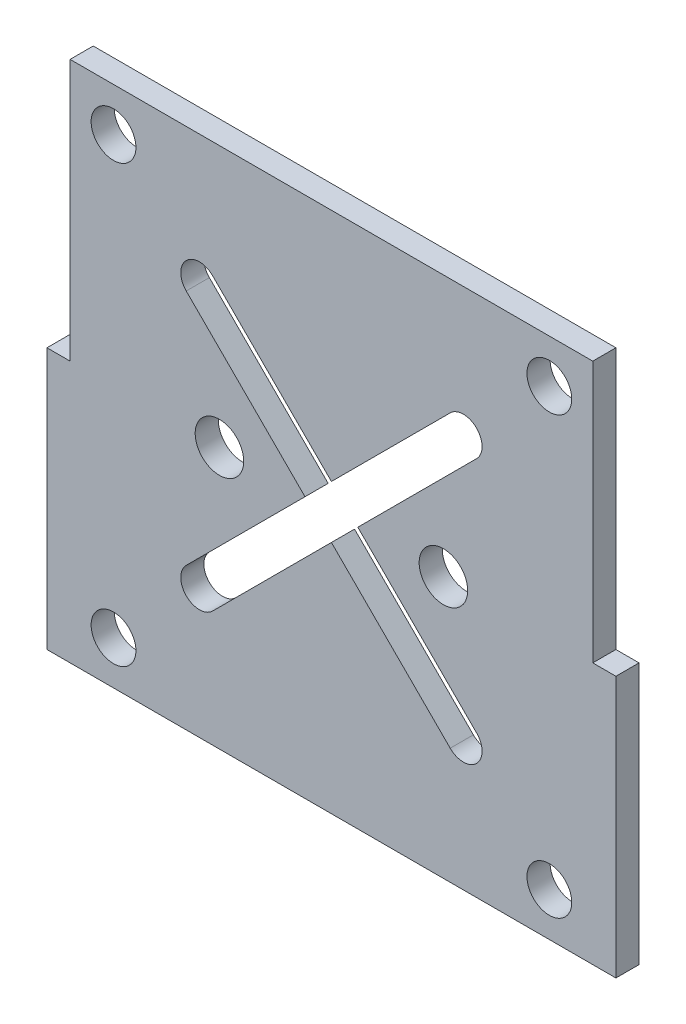
ISO-10303-21;
HEADER;
FILE_DESCRIPTION(('STEP AP214'),'2;1');
FILE_NAME('part.step','',(''),(''),'','','');
FILE_SCHEMA(('AUTOMOTIVE_DESIGN { 1 0 10303 214 1 1 1 1 }'));
ENDSEC;
DATA;
#1=APPLICATION_CONTEXT('core data for automotive mechanical design processes');
#2=APPLICATION_PROTOCOL_DEFINITION('international standard','automotive_design',2000,#1);
#3=PRODUCT_CONTEXT('',#1,'mechanical');
#4=PRODUCT('Part','Part','',(#3));
#5=PRODUCT_RELATED_PRODUCT_CATEGORY('part','',(#4));
#6=PRODUCT_DEFINITION_FORMATION('','',#4);
#7=PRODUCT_DEFINITION_CONTEXT('part definition',#1,'design');
#8=PRODUCT_DEFINITION('design','',#6,#7);
#9=PRODUCT_DEFINITION_SHAPE('','',#8);
#10=(LENGTH_UNIT() NAMED_UNIT(*) SI_UNIT(.MILLI.,.METRE.));
#11=(NAMED_UNIT(*) PLANE_ANGLE_UNIT() SI_UNIT($,.RADIAN.));
#12=(NAMED_UNIT(*) SI_UNIT($,.STERADIAN.) SOLID_ANGLE_UNIT());
#13=UNCERTAINTY_MEASURE_WITH_UNIT(LENGTH_MEASURE(1.E-05),#10,'distance_accuracy_value','');
#14=(GEOMETRIC_REPRESENTATION_CONTEXT(3) GLOBAL_UNCERTAINTY_ASSIGNED_CONTEXT((#13)) GLOBAL_UNIT_ASSIGNED_CONTEXT((#10,
#11,#12)) REPRESENTATION_CONTEXT('',''));
#15=CARTESIAN_POINT('',(0.,0.,0.));
#16=DIRECTION('',(0.,0.,1.));
#17=DIRECTION('',(1.,0.,0.));
#18=AXIS2_PLACEMENT_3D('',#15,#16,#17);
#19=CARTESIAN_POINT('',(35.,-35.,3.1));
#20=DIRECTION('',(-1.,0.,0.));
#21=DIRECTION('',(0.,0.,1.));
#22=AXIS2_PLACEMENT_3D('',#19,#20,#21);
#23=PLANE('',#22);
#24=DIRECTION('',(0.,0.,1.));
#25=VECTOR('',#24,1.);
#26=CARTESIAN_POINT('',(35.,0.,0.));
#27=LINE('',#26,#25);
#28=CARTESIAN_POINT('',(35.,0.,0.));
#29=VERTEX_POINT('',#28);
#30=CARTESIAN_POINT('',(35.,0.,3.1));
#31=VERTEX_POINT('',#30);
#32=EDGE_CURVE('E351',#29,#31,#27,.T.);
#33=ORIENTED_EDGE('',*,*,#32,.F.);
#34=DIRECTION('',(0.,1.,0.));
#35=VECTOR('',#34,1.);
#36=CARTESIAN_POINT('',(35.,-35.,0.));
#37=LINE('',#36,#35);
#38=CARTESIAN_POINT('',(35.,35.,0.));
#39=VERTEX_POINT('',#38);
#40=EDGE_CURVE('E354',#29,#39,#37,.T.);
#41=ORIENTED_EDGE('',*,*,#40,.T.);
#42=DIRECTION('',(0.,0.,-1.));
#43=VECTOR('',#42,1.);
#44=CARTESIAN_POINT('',(35.,35.,3.1));
#45=LINE('',#44,#43);
#46=CARTESIAN_POINT('',(35.,35.,3.1));
#47=VERTEX_POINT('',#46);
#48=EDGE_CURVE('E267',#47,#39,#45,.T.);
#49=ORIENTED_EDGE('',*,*,#48,.F.);
#50=DIRECTION('',(0.,1.,0.));
#51=VECTOR('',#50,1.);
#52=CARTESIAN_POINT('',(35.,-35.,3.1));
#53=LINE('',#52,#51);
#54=EDGE_CURVE('E356',#31,#47,#53,.T.);
#55=ORIENTED_EDGE('',*,*,#54,.F.);
#56=EDGE_LOOP('',(#33,#41,#49,#55));
#57=FACE_BOUND('',#56,.T.);
#58=ADVANCED_FACE('F36',(#57),#23,.F.);
#59=CARTESIAN_POINT('',(0.,0.,3.1));
#60=DIRECTION('',(0.,0.,-1.));
#61=DIRECTION('',(-1.,0.,0.));
#62=AXIS2_PLACEMENT_3D('',#59,#60,#61);
#63=PLANE('',#62);
#64=DIRECTION('',(0.707106781186548,-0.707106781186547,0.));
#65=VECTOR('',#64,1.);
#66=CARTESIAN_POINT('',(-19.4473576572875,15.9118237513547,3.1));
#67=LINE('',#66,#65);
#68=CARTESIAN_POINT('',(-19.4473576572875,15.9118237513547,3.1));
#69=VERTEX_POINT('',#68);
#70=CARTESIAN_POINT('',(-3.53745508059013,0.00192117465741167,3.1));
#71=VERTEX_POINT('',#70);
#72=EDGE_CURVE('E183',#69,#71,#67,.T.);
#73=ORIENTED_EDGE('',*,*,#72,.F.);
#74=CARTESIAN_POINT('',(-17.6795907043211,17.6795907043211,3.1));
#75=DIRECTION('',(0.,0.,1.));
#76=DIRECTION('',(1.,0.,0.));
#77=AXIS2_PLACEMENT_3D('',#74,#75,#76);
#78=CIRCLE('',#77,2.5);
#79=CARTESIAN_POINT('',(-15.9118237513547,19.4473576572875,3.1));
#80=VERTEX_POINT('',#79);
#81=EDGE_CURVE('E50',#80,#69,#78,.T.);
#82=ORIENTED_EDGE('',*,*,#81,.F.);
#83=DIRECTION('',(-0.707106781186547,0.707106781186548,0.));
#84=VECTOR('',#83,1.);
#85=CARTESIAN_POINT('',(-15.9118237513547,19.4473576572875,3.1));
#86=LINE('',#85,#84);
#87=CARTESIAN_POINT('',(-0.00192117465740766,3.53745508059014,3.1));
#88=VERTEX_POINT('',#87);
#89=EDGE_CURVE('E217',#88,#80,#86,.T.);
#90=ORIENTED_EDGE('',*,*,#89,.F.);
#91=DIRECTION('',(-0.707106781186547,-0.707106781186548,0.));
#92=VECTOR('',#91,1.);
#93=CARTESIAN_POINT('',(15.9079814020399,19.4473576572875,3.1));
#94=LINE('',#93,#92);
#95=CARTESIAN_POINT('',(15.9079814020399,19.4473576572875,3.1));
#96=VERTEX_POINT('',#95);
#97=EDGE_CURVE('E214',#96,#88,#94,.T.);
#98=ORIENTED_EDGE('',*,*,#97,.F.);
#99=CARTESIAN_POINT('',(17.6757483550063,17.6795907043211,3.1));
#100=DIRECTION('',(0.,0.,1.));
#101=DIRECTION('',(1.,0.,0.));
#102=AXIS2_PLACEMENT_3D('',#99,#100,#101);
#103=CIRCLE('',#102,2.5);
#104=CARTESIAN_POINT('',(19.4435153079727,15.9118237513547,3.1));
#105=VERTEX_POINT('',#104);
#106=EDGE_CURVE('E211',#105,#96,#103,.T.);
#107=ORIENTED_EDGE('',*,*,#106,.F.);
#108=DIRECTION('',(0.707106781186548,0.707106781186547,0.));
#109=VECTOR('',#108,1.);
#110=CARTESIAN_POINT('',(19.4435153079727,15.9118237513547,3.1));
#111=LINE('',#110,#109);
#112=CARTESIAN_POINT('',(3.53361273127532,0.00192117465741178,3.1));
#113=VERTEX_POINT('',#112);
#114=EDGE_CURVE('E208',#113,#105,#111,.T.);
#115=ORIENTED_EDGE('',*,*,#114,.F.);
#116=DIRECTION('',(-0.707106781186548,0.707106781186547,0.));
#117=VECTOR('',#116,1.);
#118=CARTESIAN_POINT('',(19.4435153079727,-15.9079814020399,3.1));
#119=LINE('',#118,#117);
#120=CARTESIAN_POINT('',(19.4435153079727,-15.9079814020399,3.1));
#121=VERTEX_POINT('',#120);
#122=EDGE_CURVE('E205',#121,#113,#119,.T.);
#123=ORIENTED_EDGE('',*,*,#122,.F.);
#124=CARTESIAN_POINT('',(17.6757483550063,-17.6757483550063,3.1));
#125=DIRECTION('',(0.,0.,1.));
#126=DIRECTION('',(1.,0.,0.));
#127=AXIS2_PLACEMENT_3D('',#124,#125,#126);
#128=CIRCLE('',#127,2.5);
#129=CARTESIAN_POINT('',(15.9079814020399,-19.4435153079726,3.1));
#130=VERTEX_POINT('',#129);
#131=EDGE_CURVE('E202',#130,#121,#128,.T.);
#132=ORIENTED_EDGE('',*,*,#131,.F.);
#133=DIRECTION('',(0.707106781186547,-0.707106781186548,0.));
#134=VECTOR('',#133,1.);
#135=CARTESIAN_POINT('',(15.9079814020399,-19.4435153079726,3.1));
#136=LINE('',#135,#134);
#137=CARTESIAN_POINT('',(-0.00192117465740542,-3.53361273127531,3.1));
#138=VERTEX_POINT('',#137);
#139=EDGE_CURVE('E199',#138,#130,#136,.T.);
#140=ORIENTED_EDGE('',*,*,#139,.F.);
#141=DIRECTION('',(0.707106781186547,0.707106781186548,0.));
#142=VECTOR('',#141,1.);
#143=CARTESIAN_POINT('',(-15.9118237513547,-19.4435153079727,3.1));
#144=LINE('',#143,#142);
#145=CARTESIAN_POINT('',(-15.9118237513547,-19.4435153079727,3.1));
#146=VERTEX_POINT('',#145);
#147=EDGE_CURVE('E193',#146,#138,#144,.T.);
#148=ORIENTED_EDGE('',*,*,#147,.F.);
#149=CARTESIAN_POINT('',(-17.6795907043211,-17.6757483550063,3.1));
#150=DIRECTION('',(0.,0.,1.));
#151=DIRECTION('',(1.,0.,0.));
#152=AXIS2_PLACEMENT_3D('',#149,#150,#151);
#153=CIRCLE('',#152,2.5);
#154=CARTESIAN_POINT('',(-19.4473576572875,-15.9079814020399,3.1));
#155=VERTEX_POINT('',#154);
#156=EDGE_CURVE('E191',#155,#146,#153,.T.);
#157=ORIENTED_EDGE('',*,*,#156,.F.);
#158=DIRECTION('',(-0.707106781186548,-0.707106781186547,0.));
#159=VECTOR('',#158,1.);
#160=CARTESIAN_POINT('',(-19.4473576572875,-15.9079814020399,3.1));
#161=LINE('',#160,#159);
#162=EDGE_CURVE('E174',#71,#155,#161,.T.);
#163=ORIENTED_EDGE('',*,*,#162,.F.);
#164=EDGE_LOOP('',(#73,#82,#90,#98,#107,#115,#123,#132,#140,#148,#157,#163));
#165=FACE_BOUND('',#164,.T.);
#166=CARTESIAN_POINT('',(-29.1858323934747,-29.1858323934748,3.1));
#167=DIRECTION('',(0.,0.,1.));
#168=DIRECTION('',(1.,0.,0.));
#169=AXIS2_PLACEMENT_3D('',#166,#167,#168);
#170=CIRCLE('',#169,3.);
#171=CARTESIAN_POINT('',(-26.1858323934747,-29.1858323934748,3.1));
#172=VERTEX_POINT('',#171);
#173=EDGE_CURVE('E434',#172,#172,#170,.T.);
#174=ORIENTED_EDGE('',*,*,#173,.F.);
#175=EDGE_LOOP('',(#174));
#176=FACE_BOUND('',#175,.T.);
#177=CARTESIAN_POINT('',(29.1858323934747,29.1858323934747,3.1));
#178=DIRECTION('',(0.,0.,1.));
#179=DIRECTION('',(1.,0.,0.));
#180=AXIS2_PLACEMENT_3D('',#177,#178,#179);
#181=CIRCLE('',#180,3.);
#182=CARTESIAN_POINT('',(32.1858323934747,29.1858323934747,3.1));
#183=VERTEX_POINT('',#182);
#184=EDGE_CURVE('E422',#183,#183,#181,.T.);
#185=ORIENTED_EDGE('',*,*,#184,.F.);
#186=EDGE_LOOP('',(#185));
#187=FACE_BOUND('',#186,.T.);
#188=CARTESIAN_POINT('',(-29.1858323934747,29.1858323934747,3.1));
#189=DIRECTION('',(0.,0.,1.));
#190=DIRECTION('',(1.,0.,0.));
#191=AXIS2_PLACEMENT_3D('',#188,#189,#190);
#192=CIRCLE('',#191,3.);
#193=CARTESIAN_POINT('',(-26.1858323934747,29.1858323934747,3.1));
#194=VERTEX_POINT('',#193);
#195=EDGE_CURVE('E373',#194,#194,#192,.T.);
#196=ORIENTED_EDGE('',*,*,#195,.F.);
#197=EDGE_LOOP('',(#196));
#198=FACE_BOUND('',#197,.T.);
#199=DIRECTION('',(1.,0.,0.));
#200=VECTOR('',#199,1.);
#201=CARTESIAN_POINT('',(-35.,-35.,3.1));
#202=LINE('',#201,#200);
#203=CARTESIAN_POINT('',(-38.1,-35.,3.1));
#204=VERTEX_POINT('',#203);
#205=CARTESIAN_POINT('',(38.1,-35.,3.1));
#206=VERTEX_POINT('',#205);
#207=EDGE_CURVE('E403',#204,#206,#202,.T.);
#208=ORIENTED_EDGE('',*,*,#207,.T.);
#209=DIRECTION('',(0.,1.,0.));
#210=VECTOR('',#209,1.);
#211=CARTESIAN_POINT('',(38.1,0.,3.1));
#212=LINE('',#211,#210);
#213=CARTESIAN_POINT('',(38.1,0.,3.1));
#214=VERTEX_POINT('',#213);
#215=EDGE_CURVE('E377',#206,#214,#212,.T.);
#216=ORIENTED_EDGE('',*,*,#215,.T.);
#217=DIRECTION('',(-1.,0.,0.));
#218=VECTOR('',#217,1.);
#219=CARTESIAN_POINT('',(35.,0.,3.1));
#220=LINE('',#219,#218);
#221=EDGE_CURVE('E258',#214,#31,#220,.T.);
#222=ORIENTED_EDGE('',*,*,#221,.T.);
#223=ORIENTED_EDGE('',*,*,#54,.T.);
#224=DIRECTION('',(-1.,0.,0.));
#225=VECTOR('',#224,1.);
#226=CARTESIAN_POINT('',(-35.,35.,3.1));
#227=LINE('',#226,#225);
#228=CARTESIAN_POINT('',(-35.,35.,3.1));
#229=VERTEX_POINT('',#228);
#230=EDGE_CURVE('E410',#47,#229,#227,.T.);
#231=ORIENTED_EDGE('',*,*,#230,.T.);
#232=DIRECTION('',(0.,-1.,0.));
#233=VECTOR('',#232,1.);
#234=CARTESIAN_POINT('',(-35.,-35.,3.1));
#235=LINE('',#234,#233);
#236=CARTESIAN_POINT('',(-35.,0.,3.1));
#237=VERTEX_POINT('',#236);
#238=EDGE_CURVE('E393',#229,#237,#235,.T.);
#239=ORIENTED_EDGE('',*,*,#238,.T.);
#240=DIRECTION('',(-1.,0.,0.));
#241=VECTOR('',#240,1.);
#242=CARTESIAN_POINT('',(-35.,0.,3.1));
#243=LINE('',#242,#241);
#244=CARTESIAN_POINT('',(-38.1,0.,3.1));
#245=VERTEX_POINT('',#244);
#246=EDGE_CURVE('E222',#237,#245,#243,.T.);
#247=ORIENTED_EDGE('',*,*,#246,.T.);
#248=DIRECTION('',(0.,-1.,0.));
#249=VECTOR('',#248,1.);
#250=CARTESIAN_POINT('',(-38.1,0.,3.1));
#251=LINE('',#250,#249);
#252=EDGE_CURVE('E246',#245,#204,#251,.T.);
#253=ORIENTED_EDGE('',*,*,#252,.T.);
#254=EDGE_LOOP('',(#208,#216,#222,#223,#231,#239,#247,#253));
#255=FACE_BOUND('',#254,.T.);
#256=CARTESIAN_POINT('',(15.,0.,3.1));
#257=DIRECTION('',(0.,0.,1.));
#258=DIRECTION('',(1.,0.,0.));
#259=AXIS2_PLACEMENT_3D('',#256,#257,#258);
#260=CIRCLE('',#259,3.25);
#261=CARTESIAN_POINT('',(18.25,0.,3.1));
#262=VERTEX_POINT('',#261);
#263=EDGE_CURVE('E416',#262,#262,#260,.T.);
#264=ORIENTED_EDGE('',*,*,#263,.F.);
#265=EDGE_LOOP('',(#264));
#266=FACE_BOUND('',#265,.T.);
#267=CARTESIAN_POINT('',(29.1858323934747,-29.1858323934747,3.1));
#268=DIRECTION('',(0.,0.,1.));
#269=DIRECTION('',(1.,0.,0.));
#270=AXIS2_PLACEMENT_3D('',#267,#268,#269);
#271=CIRCLE('',#270,3.);
#272=CARTESIAN_POINT('',(32.1858323934747,-29.1858323934747,3.1));
#273=VERTEX_POINT('',#272);
#274=EDGE_CURVE('E428',#273,#273,#271,.T.);
#275=ORIENTED_EDGE('',*,*,#274,.F.);
#276=EDGE_LOOP('',(#275));
#277=FACE_BOUND('',#276,.T.);
#278=CARTESIAN_POINT('',(-15.,0.,3.1));
#279=DIRECTION('',(0.,0.,1.));
#280=DIRECTION('',(-1.,0.,0.));
#281=AXIS2_PLACEMENT_3D('',#278,#279,#280);
#282=CIRCLE('',#281,3.25);
#283=CARTESIAN_POINT('',(-18.25,0.,3.1));
#284=VERTEX_POINT('',#283);
#285=EDGE_CURVE('E440',#284,#284,#282,.T.);
#286=ORIENTED_EDGE('',*,*,#285,.F.);
#287=EDGE_LOOP('',(#286));
#288=FACE_BOUND('',#287,.T.);
#289=ADVANCED_FACE('F187',(#165,#176,#187,#198,#255,#266,#277,#288),#63,.F.);
#290=CARTESIAN_POINT('',(0.,0.,0.));
#291=DIRECTION('',(0.,0.,-1.));
#292=DIRECTION('',(-1.,0.,0.));
#293=AXIS2_PLACEMENT_3D('',#290,#291,#292);
#294=PLANE('',#293);
#295=CARTESIAN_POINT('',(-17.6795907043211,17.6795907043211,0.));
#296=DIRECTION('',(0.,0.,-1.));
#297=DIRECTION('',(-1.,0.,0.));
#298=AXIS2_PLACEMENT_3D('',#295,#296,#297);
#299=CIRCLE('',#298,2.5);
#300=CARTESIAN_POINT('',(-19.4473576572875,15.9118237513547,0.));
#301=VERTEX_POINT('',#300);
#302=CARTESIAN_POINT('',(-15.9118237513547,19.4473576572875,0.));
#303=VERTEX_POINT('',#302);
#304=EDGE_CURVE('E11',#301,#303,#299,.T.);
#305=ORIENTED_EDGE('',*,*,#304,.F.);
#306=DIRECTION('',(-0.707106781186548,0.707106781186547,0.));
#307=VECTOR('',#306,1.);
#308=CARTESIAN_POINT('',(-1.76776695296636,-1.76776695296636,0.));
#309=LINE('',#308,#307);
#310=CARTESIAN_POINT('',(-3.53745508059013,0.00192117465741201,0.));
#311=VERTEX_POINT('',#310);
#312=EDGE_CURVE('E265',#311,#301,#309,.T.);
#313=ORIENTED_EDGE('',*,*,#312,.F.);
#314=DIRECTION('',(0.707106781186548,0.707106781186547,0.));
#315=VECTOR('',#314,1.);
#316=CARTESIAN_POINT('',(-1.76968812762377,1.76968812762377,0.));
#317=LINE('',#316,#315);
#318=CARTESIAN_POINT('',(-19.4473576572875,-15.9079814020399,0.));
#319=VERTEX_POINT('',#318);
#320=EDGE_CURVE('E177',#319,#311,#317,.T.);
#321=ORIENTED_EDGE('',*,*,#320,.F.);
#322=CARTESIAN_POINT('',(-17.6795907043211,-17.6757483550063,0.));
#323=DIRECTION('',(0.,0.,-1.));
#324=DIRECTION('',(-1.,0.,0.));
#325=AXIS2_PLACEMENT_3D('',#322,#323,#324);
#326=CIRCLE('',#325,2.5);
#327=CARTESIAN_POINT('',(-15.9118237513547,-19.4435153079727,0.));
#328=VERTEX_POINT('',#327);
#329=EDGE_CURVE('E269',#328,#319,#326,.T.);
#330=ORIENTED_EDGE('',*,*,#329,.F.);
#331=DIRECTION('',(-0.707106781186547,-0.707106781186548,0.));
#332=VECTOR('',#331,1.);
#333=CARTESIAN_POINT('',(1.76584577830895,-1.76584577830895,0.));
#334=LINE('',#333,#332);
#335=CARTESIAN_POINT('',(-0.00192117465740542,-3.53361273127531,0.));
#336=VERTEX_POINT('',#335);
#337=EDGE_CURVE('E271',#336,#328,#334,.T.);
#338=ORIENTED_EDGE('',*,*,#337,.F.);
#339=DIRECTION('',(-0.707106781186547,0.707106781186548,0.));
#340=VECTOR('',#339,1.);
#341=CARTESIAN_POINT('',(-1.76776695296636,-1.76776695296636,0.));
#342=LINE('',#341,#340);
#343=CARTESIAN_POINT('',(15.9079814020399,-19.4435153079726,0.));
#344=VERTEX_POINT('',#343);
#345=EDGE_CURVE('E273',#344,#336,#342,.T.);
#346=ORIENTED_EDGE('',*,*,#345,.F.);
#347=CARTESIAN_POINT('',(17.6757483550063,-17.6757483550063,0.));
#348=DIRECTION('',(0.,0.,-1.));
#349=DIRECTION('',(-1.,0.,0.));
#350=AXIS2_PLACEMENT_3D('',#347,#348,#349);
#351=CIRCLE('',#350,2.5);
#352=CARTESIAN_POINT('',(19.4435153079727,-15.9079814020399,0.));
#353=VERTEX_POINT('',#352);
#354=EDGE_CURVE('E275',#353,#344,#351,.T.);
#355=ORIENTED_EDGE('',*,*,#354,.F.);
#356=DIRECTION('',(0.707106781186548,-0.707106781186547,0.));
#357=VECTOR('',#356,1.);
#358=CARTESIAN_POINT('',(1.76776695296636,1.76776695296636,0.));
#359=LINE('',#358,#357);
#360=CARTESIAN_POINT('',(3.53361273127532,0.00192117465741178,0.));
#361=VERTEX_POINT('',#360);
#362=EDGE_CURVE('E277',#361,#353,#359,.T.);
#363=ORIENTED_EDGE('',*,*,#362,.F.);
#364=DIRECTION('',(-0.707106781186548,-0.707106781186547,0.));
#365=VECTOR('',#364,1.);
#366=CARTESIAN_POINT('',(1.76584577830895,-1.76584577830895,0.));
#367=LINE('',#366,#365);
#368=CARTESIAN_POINT('',(19.4435153079727,15.9118237513547,0.));
#369=VERTEX_POINT('',#368);
#370=EDGE_CURVE('E279',#369,#361,#367,.T.);
#371=ORIENTED_EDGE('',*,*,#370,.F.);
#372=CARTESIAN_POINT('',(17.6757483550063,17.6795907043211,0.));
#373=DIRECTION('',(0.,0.,-1.));
#374=DIRECTION('',(-1.,0.,0.));
#375=AXIS2_PLACEMENT_3D('',#372,#373,#374);
#376=CIRCLE('',#375,2.5);
#377=CARTESIAN_POINT('',(15.9079814020399,19.4473576572875,0.));
#378=VERTEX_POINT('',#377);
#379=EDGE_CURVE('E281',#378,#369,#376,.T.);
#380=ORIENTED_EDGE('',*,*,#379,.F.);
#381=DIRECTION('',(0.707106781186547,0.707106781186548,0.));
#382=VECTOR('',#381,1.);
#383=CARTESIAN_POINT('',(-1.76968812762377,1.76968812762377,0.));
#384=LINE('',#383,#382);
#385=CARTESIAN_POINT('',(-0.00192117465740766,3.53745508059014,0.));
#386=VERTEX_POINT('',#385);
#387=EDGE_CURVE('E283',#386,#378,#384,.T.);
#388=ORIENTED_EDGE('',*,*,#387,.F.);
#389=DIRECTION('',(0.707106781186547,-0.707106781186548,0.));
#390=VECTOR('',#389,1.);
#391=CARTESIAN_POINT('',(1.76776695296636,1.76776695296636,0.));
#392=LINE('',#391,#390);
#393=EDGE_CURVE('E43',#303,#386,#392,.T.);
#394=ORIENTED_EDGE('',*,*,#393,.F.);
#395=EDGE_LOOP('',(#305,#313,#321,#330,#338,#346,#355,#363,#371,#380,#388,#394));
#396=FACE_BOUND('',#395,.T.);
#397=CARTESIAN_POINT('',(-29.1858323934747,-29.1858323934748,0.));
#398=DIRECTION('',(0.,0.,1.));
#399=DIRECTION('',(1.,0.,0.));
#400=AXIS2_PLACEMENT_3D('',#397,#398,#399);
#401=CIRCLE('',#400,3.);
#402=CARTESIAN_POINT('',(-26.1858323934747,-29.1858323934748,0.));
#403=VERTEX_POINT('',#402);
#404=EDGE_CURVE('E437',#403,#403,#401,.T.);
#405=ORIENTED_EDGE('',*,*,#404,.T.);
#406=EDGE_LOOP('',(#405));
#407=FACE_BOUND('',#406,.T.);
#408=CARTESIAN_POINT('',(29.1858323934747,29.1858323934747,0.));
#409=DIRECTION('',(0.,0.,1.));
#410=DIRECTION('',(1.,0.,0.));
#411=AXIS2_PLACEMENT_3D('',#408,#409,#410);
#412=CIRCLE('',#411,3.);
#413=CARTESIAN_POINT('',(32.1858323934747,29.1858323934747,0.));
#414=VERTEX_POINT('',#413);
#415=EDGE_CURVE('E425',#414,#414,#412,.T.);
#416=ORIENTED_EDGE('',*,*,#415,.T.);
#417=EDGE_LOOP('',(#416));
#418=FACE_BOUND('',#417,.T.);
#419=CARTESIAN_POINT('',(-29.1858323934747,29.1858323934747,0.));
#420=DIRECTION('',(0.,0.,1.));
#421=DIRECTION('',(1.,0.,0.));
#422=AXIS2_PLACEMENT_3D('',#419,#420,#421);
#423=CIRCLE('',#422,3.);
#424=CARTESIAN_POINT('',(-26.1858323934747,29.1858323934747,0.));
#425=VERTEX_POINT('',#424);
#426=EDGE_CURVE('E413',#425,#425,#423,.T.);
#427=ORIENTED_EDGE('',*,*,#426,.T.);
#428=EDGE_LOOP('',(#427));
#429=FACE_BOUND('',#428,.T.);
#430=ORIENTED_EDGE('',*,*,#40,.F.);
#431=DIRECTION('',(-1.,0.,0.));
#432=VECTOR('',#431,1.);
#433=CARTESIAN_POINT('',(35.,0.,0.));
#434=LINE('',#433,#432);
#435=CARTESIAN_POINT('',(38.1,0.,0.));
#436=VERTEX_POINT('',#435);
#437=EDGE_CURVE('E368',#436,#29,#434,.T.);
#438=ORIENTED_EDGE('',*,*,#437,.F.);
#439=DIRECTION('',(0.,1.,0.));
#440=VECTOR('',#439,1.);
#441=CARTESIAN_POINT('',(38.1,0.,0.));
#442=LINE('',#441,#440);
#443=CARTESIAN_POINT('',(38.1,-35.,0.));
#444=VERTEX_POINT('',#443);
#445=EDGE_CURVE('E362',#444,#436,#442,.T.);
#446=ORIENTED_EDGE('',*,*,#445,.F.);
#447=DIRECTION('',(1.,0.,0.));
#448=VECTOR('',#447,1.);
#449=CARTESIAN_POINT('',(-35.,-35.,0.));
#450=LINE('',#449,#448);
#451=CARTESIAN_POINT('',(-38.1,-35.,0.));
#452=VERTEX_POINT('',#451);
#453=EDGE_CURVE('E392',#452,#444,#450,.T.);
#454=ORIENTED_EDGE('',*,*,#453,.F.);
#455=DIRECTION('',(0.,-1.,0.));
#456=VECTOR('',#455,1.);
#457=CARTESIAN_POINT('',(-38.1,0.,0.));
#458=LINE('',#457,#456);
#459=CARTESIAN_POINT('',(-38.1,0.,0.));
#460=VERTEX_POINT('',#459);
#461=EDGE_CURVE('E241',#460,#452,#458,.T.);
#462=ORIENTED_EDGE('',*,*,#461,.F.);
#463=DIRECTION('',(-1.,0.,0.));
#464=VECTOR('',#463,1.);
#465=CARTESIAN_POINT('',(-35.,0.,0.));
#466=LINE('',#465,#464);
#467=CARTESIAN_POINT('',(-35.,0.,0.));
#468=VERTEX_POINT('',#467);
#469=EDGE_CURVE('E245',#468,#460,#466,.T.);
#470=ORIENTED_EDGE('',*,*,#469,.F.);
#471=DIRECTION('',(0.,-1.,0.));
#472=VECTOR('',#471,1.);
#473=CARTESIAN_POINT('',(-35.,-35.,0.));
#474=LINE('',#473,#472);
#475=CARTESIAN_POINT('',(-35.,35.,0.));
#476=VERTEX_POINT('',#475);
#477=EDGE_CURVE('E388',#476,#468,#474,.T.);
#478=ORIENTED_EDGE('',*,*,#477,.F.);
#479=DIRECTION('',(-1.,0.,0.));
#480=VECTOR('',#479,1.);
#481=CARTESIAN_POINT('',(-35.,35.,0.));
#482=LINE('',#481,#480);
#483=EDGE_CURVE('E371',#39,#476,#482,.T.);
#484=ORIENTED_EDGE('',*,*,#483,.F.);
#485=EDGE_LOOP('',(#430,#438,#446,#454,#462,#470,#478,#484));
#486=FACE_BOUND('',#485,.T.);
#487=CARTESIAN_POINT('',(15.,0.,0.));
#488=DIRECTION('',(0.,0.,1.));
#489=DIRECTION('',(1.,0.,0.));
#490=AXIS2_PLACEMENT_3D('',#487,#488,#489);
#491=CIRCLE('',#490,3.25);
#492=CARTESIAN_POINT('',(18.25,0.,0.));
#493=VERTEX_POINT('',#492);
#494=EDGE_CURVE('E419',#493,#493,#491,.T.);
#495=ORIENTED_EDGE('',*,*,#494,.T.);
#496=EDGE_LOOP('',(#495));
#497=FACE_BOUND('',#496,.T.);
#498=CARTESIAN_POINT('',(29.1858323934747,-29.1858323934747,0.));
#499=DIRECTION('',(0.,0.,1.));
#500=DIRECTION('',(1.,0.,0.));
#501=AXIS2_PLACEMENT_3D('',#498,#499,#500);
#502=CIRCLE('',#501,3.);
#503=CARTESIAN_POINT('',(32.1858323934747,-29.1858323934747,0.));
#504=VERTEX_POINT('',#503);
#505=EDGE_CURVE('E431',#504,#504,#502,.T.);
#506=ORIENTED_EDGE('',*,*,#505,.T.);
#507=EDGE_LOOP('',(#506));
#508=FACE_BOUND('',#507,.T.);
#509=CARTESIAN_POINT('',(-15.,0.,0.));
#510=DIRECTION('',(0.,0.,1.));
#511=DIRECTION('',(-1.,0.,0.));
#512=AXIS2_PLACEMENT_3D('',#509,#510,#511);
#513=CIRCLE('',#512,3.25);
#514=CARTESIAN_POINT('',(-18.25,0.,0.));
#515=VERTEX_POINT('',#514);
#516=EDGE_CURVE('E443',#515,#515,#513,.T.);
#517=ORIENTED_EDGE('',*,*,#516,.T.);
#518=EDGE_LOOP('',(#517));
#519=FACE_BOUND('',#518,.T.);
#520=ADVANCED_FACE('F298',(#396,#407,#418,#429,#486,#497,#508,#519),#294,.T.);
#521=CARTESIAN_POINT('',(-35.,35.,3.1));
#522=DIRECTION('',(0.,-1.,0.));
#523=DIRECTION('',(0.,0.,-1.));
#524=AXIS2_PLACEMENT_3D('',#521,#522,#523);
#525=PLANE('',#524);
#526=ORIENTED_EDGE('',*,*,#483,.T.);
#527=DIRECTION('',(0.,0.,-1.));
#528=VECTOR('',#527,1.);
#529=CARTESIAN_POINT('',(-35.,35.,3.1));
#530=LINE('',#529,#528);
#531=EDGE_CURVE('E400',#229,#476,#530,.T.);
#532=ORIENTED_EDGE('',*,*,#531,.F.);
#533=ORIENTED_EDGE('',*,*,#230,.F.);
#534=ORIENTED_EDGE('',*,*,#48,.T.);
#535=EDGE_LOOP('',(#526,#532,#533,#534));
#536=FACE_BOUND('',#535,.T.);
#537=ADVANCED_FACE('F483',(#536),#525,.F.);
#538=CARTESIAN_POINT('',(-35.,-35.,3.1));
#539=DIRECTION('',(1.,0.,0.));
#540=DIRECTION('',(0.,0.,-1.));
#541=AXIS2_PLACEMENT_3D('',#538,#539,#540);
#542=PLANE('',#541);
#543=ORIENTED_EDGE('',*,*,#477,.T.);
#544=DIRECTION('',(0.,0.,1.));
#545=VECTOR('',#544,1.);
#546=CARTESIAN_POINT('',(-35.,0.,0.));
#547=LINE('',#546,#545);
#548=EDGE_CURVE('E254',#468,#237,#547,.T.);
#549=ORIENTED_EDGE('',*,*,#548,.T.);
#550=ORIENTED_EDGE('',*,*,#238,.F.);
#551=ORIENTED_EDGE('',*,*,#531,.T.);
#552=EDGE_LOOP('',(#543,#549,#550,#551));
#553=FACE_BOUND('',#552,.T.);
#554=ADVANCED_FACE('F470',(#553),#542,.F.);
#555=CARTESIAN_POINT('',(-35.,-35.,3.1));
#556=DIRECTION('',(0.,1.,0.));
#557=DIRECTION('',(0.,0.,1.));
#558=AXIS2_PLACEMENT_3D('',#555,#556,#557);
#559=PLANE('',#558);
#560=ORIENTED_EDGE('',*,*,#453,.T.);
#561=DIRECTION('',(0.,0.,1.));
#562=VECTOR('',#561,1.);
#563=CARTESIAN_POINT('',(38.1,-35.,0.));
#564=LINE('',#563,#562);
#565=EDGE_CURVE('E361',#444,#206,#564,.T.);
#566=ORIENTED_EDGE('',*,*,#565,.T.);
#567=ORIENTED_EDGE('',*,*,#207,.F.);
#568=DIRECTION('',(0.,0.,1.));
#569=VECTOR('',#568,1.);
#570=CARTESIAN_POINT('',(-38.1,-35.,0.));
#571=LINE('',#570,#569);
#572=EDGE_CURVE('E251',#452,#204,#571,.T.);
#573=ORIENTED_EDGE('',*,*,#572,.F.);
#574=EDGE_LOOP('',(#560,#566,#567,#573));
#575=FACE_BOUND('',#574,.T.);
#576=ADVANCED_FACE('F472',(#575),#559,.F.);
#577=CARTESIAN_POINT('',(-29.1858323934747,29.1858323934747,3.1));
#578=DIRECTION('',(0.,0.,-1.));
#579=DIRECTION('',(-1.,0.,0.));
#580=AXIS2_PLACEMENT_3D('',#577,#578,#579);
#581=CYLINDRICAL_SURFACE('',#580,3.);
#582=ORIENTED_EDGE('',*,*,#195,.T.);
#583=EDGE_LOOP('',(#582));
#584=FACE_BOUND('',#583,.T.);
#585=ORIENTED_EDGE('',*,*,#426,.F.);
#586=EDGE_LOOP('',(#585));
#587=FACE_BOUND('',#586,.T.);
#588=ADVANCED_FACE('F474',(#584,#587),#581,.F.);
#589=CARTESIAN_POINT('',(15.,0.,3.1));
#590=DIRECTION('',(0.,0.,-1.));
#591=DIRECTION('',(-1.,0.,0.));
#592=AXIS2_PLACEMENT_3D('',#589,#590,#591);
#593=CYLINDRICAL_SURFACE('',#592,3.25);
#594=ORIENTED_EDGE('',*,*,#263,.T.);
#595=EDGE_LOOP('',(#594));
#596=FACE_BOUND('',#595,.T.);
#597=ORIENTED_EDGE('',*,*,#494,.F.);
#598=EDGE_LOOP('',(#597));
#599=FACE_BOUND('',#598,.T.);
#600=ADVANCED_FACE('F480',(#596,#599),#593,.F.);
#601=CARTESIAN_POINT('',(29.1858323934747,29.1858323934747,3.1));
#602=DIRECTION('',(0.,0.,-1.));
#603=DIRECTION('',(-1.,0.,0.));
#604=AXIS2_PLACEMENT_3D('',#601,#602,#603);
#605=CYLINDRICAL_SURFACE('',#604,3.);
#606=ORIENTED_EDGE('',*,*,#184,.T.);
#607=EDGE_LOOP('',(#606));
#608=FACE_BOUND('',#607,.T.);
#609=ORIENTED_EDGE('',*,*,#415,.F.);
#610=EDGE_LOOP('',(#609));
#611=FACE_BOUND('',#610,.T.);
#612=ADVANCED_FACE('F577',(#608,#611),#605,.F.);
#613=CARTESIAN_POINT('',(29.1858323934747,-29.1858323934747,3.1));
#614=DIRECTION('',(0.,0.,-1.));
#615=DIRECTION('',(-1.,0.,0.));
#616=AXIS2_PLACEMENT_3D('',#613,#614,#615);
#617=CYLINDRICAL_SURFACE('',#616,3.);
#618=ORIENTED_EDGE('',*,*,#274,.T.);
#619=EDGE_LOOP('',(#618));
#620=FACE_BOUND('',#619,.T.);
#621=ORIENTED_EDGE('',*,*,#505,.F.);
#622=EDGE_LOOP('',(#621));
#623=FACE_BOUND('',#622,.T.);
#624=ADVANCED_FACE('F567',(#620,#623),#617,.F.);
#625=CARTESIAN_POINT('',(-29.1858323934747,-29.1858323934748,3.1));
#626=DIRECTION('',(0.,0.,-1.));
#627=DIRECTION('',(-1.,0.,0.));
#628=AXIS2_PLACEMENT_3D('',#625,#626,#627);
#629=CYLINDRICAL_SURFACE('',#628,3.);
#630=ORIENTED_EDGE('',*,*,#173,.T.);
#631=EDGE_LOOP('',(#630));
#632=FACE_BOUND('',#631,.T.);
#633=ORIENTED_EDGE('',*,*,#404,.F.);
#634=EDGE_LOOP('',(#633));
#635=FACE_BOUND('',#634,.T.);
#636=ADVANCED_FACE('F557',(#632,#635),#629,.F.);
#637=CARTESIAN_POINT('',(-15.,0.,3.1));
#638=DIRECTION('',(0.,0.,-1.));
#639=DIRECTION('',(-1.,0.,0.));
#640=AXIS2_PLACEMENT_3D('',#637,#638,#639);
#641=CYLINDRICAL_SURFACE('',#640,3.25);
#642=ORIENTED_EDGE('',*,*,#285,.T.);
#643=EDGE_LOOP('',(#642));
#644=FACE_BOUND('',#643,.T.);
#645=ORIENTED_EDGE('',*,*,#516,.F.);
#646=EDGE_LOOP('',(#645));
#647=FACE_BOUND('',#646,.T.);
#648=ADVANCED_FACE('F530',(#644,#647),#641,.F.);
#649=CARTESIAN_POINT('',(35.,0.,0.));
#650=DIRECTION('',(0.,1.,0.));
#651=DIRECTION('',(-1.,0.,0.));
#652=AXIS2_PLACEMENT_3D('',#649,#650,#651);
#653=PLANE('',#652);
#654=ORIENTED_EDGE('',*,*,#221,.F.);
#655=DIRECTION('',(0.,0.,1.));
#656=VECTOR('',#655,1.);
#657=CARTESIAN_POINT('',(38.1,0.,0.));
#658=LINE('',#657,#656);
#659=EDGE_CURVE('E376',#436,#214,#658,.T.);
#660=ORIENTED_EDGE('',*,*,#659,.F.);
#661=ORIENTED_EDGE('',*,*,#437,.T.);
#662=ORIENTED_EDGE('',*,*,#32,.T.);
#663=EDGE_LOOP('',(#654,#660,#661,#662));
#664=FACE_BOUND('',#663,.T.);
#665=ADVANCED_FACE('F375',(#664),#653,.T.);
#666=CARTESIAN_POINT('',(38.1,0.,0.));
#667=DIRECTION('',(1.,0.,0.));
#668=DIRECTION('',(0.,1.,0.));
#669=AXIS2_PLACEMENT_3D('',#666,#667,#668);
#670=PLANE('',#669);
#671=ORIENTED_EDGE('',*,*,#215,.F.);
#672=ORIENTED_EDGE('',*,*,#565,.F.);
#673=ORIENTED_EDGE('',*,*,#445,.T.);
#674=ORIENTED_EDGE('',*,*,#659,.T.);
#675=EDGE_LOOP('',(#671,#672,#673,#674));
#676=FACE_BOUND('',#675,.T.);
#677=ADVANCED_FACE('F458',(#676),#670,.T.);
#678=CARTESIAN_POINT('',(-35.,0.,0.));
#679=DIRECTION('',(0.,1.,0.));
#680=DIRECTION('',(-1.,0.,0.));
#681=AXIS2_PLACEMENT_3D('',#678,#679,#680);
#682=PLANE('',#681);
#683=ORIENTED_EDGE('',*,*,#246,.F.);
#684=ORIENTED_EDGE('',*,*,#548,.F.);
#685=ORIENTED_EDGE('',*,*,#469,.T.);
#686=DIRECTION('',(0.,0.,1.));
#687=VECTOR('',#686,1.);
#688=CARTESIAN_POINT('',(-38.1,0.,0.));
#689=LINE('',#688,#687);
#690=EDGE_CURVE('E244',#460,#245,#689,.T.);
#691=ORIENTED_EDGE('',*,*,#690,.T.);
#692=EDGE_LOOP('',(#683,#684,#685,#691));
#693=FACE_BOUND('',#692,.T.);
#694=ADVANCED_FACE('F340',(#693),#682,.T.);
#695=CARTESIAN_POINT('',(-38.1,0.,0.));
#696=DIRECTION('',(-1.,0.,0.));
#697=DIRECTION('',(0.,-1.,0.));
#698=AXIS2_PLACEMENT_3D('',#695,#696,#697);
#699=PLANE('',#698);
#700=ORIENTED_EDGE('',*,*,#252,.F.);
#701=ORIENTED_EDGE('',*,*,#690,.F.);
#702=ORIENTED_EDGE('',*,*,#461,.T.);
#703=ORIENTED_EDGE('',*,*,#572,.T.);
#704=EDGE_LOOP('',(#700,#701,#702,#703));
#705=FACE_BOUND('',#704,.T.);
#706=ADVANCED_FACE('F333',(#705),#699,.T.);
#707=CARTESIAN_POINT('',(-17.6795907043211,17.6795907043211,-5.00000000001367E-05));
#708=DIRECTION('',(0.,0.,1.));
#709=DIRECTION('',(1.,0.,0.));
#710=AXIS2_PLACEMENT_3D('',#707,#708,#709);
#711=CYLINDRICAL_SURFACE('',#710,2.5);
#712=ORIENTED_EDGE('',*,*,#304,.T.);
#713=DIRECTION('',(0.,0.,1.));
#714=VECTOR('',#713,1.);
#715=CARTESIAN_POINT('',(-15.9118237513547,19.4473576572875,-5.00000000001367E-05));
#716=LINE('',#715,#714);
#717=EDGE_CURVE('E220',#303,#80,#716,.T.);
#718=ORIENTED_EDGE('',*,*,#717,.T.);
#719=ORIENTED_EDGE('',*,*,#81,.T.);
#720=DIRECTION('',(0.,0.,1.));
#721=VECTOR('',#720,1.);
#722=CARTESIAN_POINT('',(-19.4473576572875,15.9118237513547,-5.00000000001367E-05));
#723=LINE('',#722,#721);
#724=EDGE_CURVE('E180',#301,#69,#723,.T.);
#725=ORIENTED_EDGE('',*,*,#724,.F.);
#726=EDGE_LOOP('',(#712,#718,#719,#725));
#727=FACE_BOUND('',#726,.T.);
#728=ADVANCED_FACE('F331',(#727),#711,.F.);
#729=CARTESIAN_POINT('',(-15.9118237513547,19.4473576572875,-5.00000000001367E-05));
#730=DIRECTION('',(0.707106781186548,0.707106781186547,0.));
#731=DIRECTION('',(-0.707106781186547,0.707106781186548,0.));
#732=AXIS2_PLACEMENT_3D('',#729,#730,#731);
#733=PLANE('',#732);
#734=ORIENTED_EDGE('',*,*,#393,.T.);
#735=DIRECTION('',(0.,0.,1.));
#736=VECTOR('',#735,1.);
#737=CARTESIAN_POINT('',(-0.00192117465740766,3.53745508059014,-5.00000000001367E-05));
#738=LINE('',#737,#736);
#739=EDGE_CURVE('E223',#386,#88,#738,.T.);
#740=ORIENTED_EDGE('',*,*,#739,.T.);
#741=ORIENTED_EDGE('',*,*,#89,.T.);
#742=ORIENTED_EDGE('',*,*,#717,.F.);
#743=EDGE_LOOP('',(#734,#740,#741,#742));
#744=FACE_BOUND('',#743,.T.);
#745=ADVANCED_FACE('F288',(#744),#733,.F.);
#746=CARTESIAN_POINT('',(15.9079814020399,19.4473576572875,-5.00000000001367E-05));
#747=DIRECTION('',(-0.707106781186548,0.707106781186547,0.));
#748=DIRECTION('',(-0.707106781186547,-0.707106781186548,0.));
#749=AXIS2_PLACEMENT_3D('',#746,#747,#748);
#750=PLANE('',#749);
#751=ORIENTED_EDGE('',*,*,#387,.T.);
#752=DIRECTION('',(0.,0.,1.));
#753=VECTOR('',#752,1.);
#754=CARTESIAN_POINT('',(15.9079814020399,19.4473576572875,-5.00000000001367E-05));
#755=LINE('',#754,#753);
#756=EDGE_CURVE('E225',#378,#96,#755,.T.);
#757=ORIENTED_EDGE('',*,*,#756,.T.);
#758=ORIENTED_EDGE('',*,*,#97,.T.);
#759=ORIENTED_EDGE('',*,*,#739,.F.);
#760=EDGE_LOOP('',(#751,#757,#758,#759));
#761=FACE_BOUND('',#760,.T.);
#762=ADVANCED_FACE('F293',(#761),#750,.F.);
#763=CARTESIAN_POINT('',(17.6757483550063,17.6795907043211,-5.00000000001367E-05));
#764=DIRECTION('',(0.,0.,1.));
#765=DIRECTION('',(1.,0.,0.));
#766=AXIS2_PLACEMENT_3D('',#763,#764,#765);
#767=CYLINDRICAL_SURFACE('',#766,2.5);
#768=ORIENTED_EDGE('',*,*,#379,.T.);
#769=DIRECTION('',(0.,0.,1.));
#770=VECTOR('',#769,1.);
#771=CARTESIAN_POINT('',(19.4435153079727,15.9118237513547,-5.00000000001367E-05));
#772=LINE('',#771,#770);
#773=EDGE_CURVE('E227',#369,#105,#772,.T.);
#774=ORIENTED_EDGE('',*,*,#773,.T.);
#775=ORIENTED_EDGE('',*,*,#106,.T.);
#776=ORIENTED_EDGE('',*,*,#756,.F.);
#777=EDGE_LOOP('',(#768,#774,#775,#776));
#778=FACE_BOUND('',#777,.T.);
#779=ADVANCED_FACE('F304',(#778),#767,.F.);
#780=CARTESIAN_POINT('',(19.4435153079727,15.9118237513547,-5.00000000001367E-05));
#781=DIRECTION('',(0.707106781186547,-0.707106781186548,0.));
#782=DIRECTION('',(0.707106781186548,0.707106781186547,0.));
#783=AXIS2_PLACEMENT_3D('',#780,#781,#782);
#784=PLANE('',#783);
#785=ORIENTED_EDGE('',*,*,#370,.T.);
#786=DIRECTION('',(0.,0.,1.));
#787=VECTOR('',#786,1.);
#788=CARTESIAN_POINT('',(3.53361273127532,0.00192117465741178,-5.00000000001367E-05));
#789=LINE('',#788,#787);
#790=EDGE_CURVE('E229',#361,#113,#789,.T.);
#791=ORIENTED_EDGE('',*,*,#790,.T.);
#792=ORIENTED_EDGE('',*,*,#114,.T.);
#793=ORIENTED_EDGE('',*,*,#773,.F.);
#794=EDGE_LOOP('',(#785,#791,#792,#793));
#795=FACE_BOUND('',#794,.T.);
#796=ADVANCED_FACE('F306',(#795),#784,.F.);
#797=CARTESIAN_POINT('',(19.4435153079727,-15.9079814020399,-5.00000000001367E-05));
#798=DIRECTION('',(0.707106781186547,0.707106781186548,0.));
#799=DIRECTION('',(-0.707106781186548,0.707106781186547,0.));
#800=AXIS2_PLACEMENT_3D('',#797,#798,#799);
#801=PLANE('',#800);
#802=ORIENTED_EDGE('',*,*,#362,.T.);
#803=DIRECTION('',(0.,0.,1.));
#804=VECTOR('',#803,1.);
#805=CARTESIAN_POINT('',(19.4435153079727,-15.9079814020399,-5.00000000001367E-05));
#806=LINE('',#805,#804);
#807=EDGE_CURVE('E231',#353,#121,#806,.T.);
#808=ORIENTED_EDGE('',*,*,#807,.T.);
#809=ORIENTED_EDGE('',*,*,#122,.T.);
#810=ORIENTED_EDGE('',*,*,#790,.F.);
#811=EDGE_LOOP('',(#802,#808,#809,#810));
#812=FACE_BOUND('',#811,.T.);
#813=ADVANCED_FACE('F314',(#812),#801,.F.);
#814=CARTESIAN_POINT('',(17.6757483550063,-17.6757483550063,-5.00000000001367E-05));
#815=DIRECTION('',(0.,0.,1.));
#816=DIRECTION('',(1.,0.,0.));
#817=AXIS2_PLACEMENT_3D('',#814,#815,#816);
#818=CYLINDRICAL_SURFACE('',#817,2.5);
#819=ORIENTED_EDGE('',*,*,#354,.T.);
#820=DIRECTION('',(0.,0.,1.));
#821=VECTOR('',#820,1.);
#822=CARTESIAN_POINT('',(15.9079814020399,-19.4435153079726,-5.00000000001367E-05));
#823=LINE('',#822,#821);
#824=EDGE_CURVE('E233',#344,#130,#823,.T.);
#825=ORIENTED_EDGE('',*,*,#824,.T.);
#826=ORIENTED_EDGE('',*,*,#131,.T.);
#827=ORIENTED_EDGE('',*,*,#807,.F.);
#828=EDGE_LOOP('',(#819,#825,#826,#827));
#829=FACE_BOUND('',#828,.T.);
#830=ADVANCED_FACE('F318',(#829),#818,.F.);
#831=CARTESIAN_POINT('',(15.9079814020399,-19.4435153079726,-5.00000000001367E-05));
#832=DIRECTION('',(-0.707106781186548,-0.707106781186547,0.));
#833=DIRECTION('',(0.707106781186547,-0.707106781186548,0.));
#834=AXIS2_PLACEMENT_3D('',#831,#832,#833);
#835=PLANE('',#834);
#836=ORIENTED_EDGE('',*,*,#345,.T.);
#837=DIRECTION('',(0.,0.,1.));
#838=VECTOR('',#837,1.);
#839=CARTESIAN_POINT('',(-0.00192117465740542,-3.53361273127531,-5.00000000001367E-05));
#840=LINE('',#839,#838);
#841=EDGE_CURVE('E235',#336,#138,#840,.T.);
#842=ORIENTED_EDGE('',*,*,#841,.T.);
#843=ORIENTED_EDGE('',*,*,#139,.T.);
#844=ORIENTED_EDGE('',*,*,#824,.F.);
#845=EDGE_LOOP('',(#836,#842,#843,#844));
#846=FACE_BOUND('',#845,.T.);
#847=ADVANCED_FACE('F322',(#846),#835,.F.);
#848=CARTESIAN_POINT('',(-15.9118237513547,-19.4435153079727,-5.00000000001367E-05));
#849=DIRECTION('',(0.707106781186548,-0.707106781186547,0.));
#850=DIRECTION('',(0.707106781186547,0.707106781186548,0.));
#851=AXIS2_PLACEMENT_3D('',#848,#849,#850);
#852=PLANE('',#851);
#853=ORIENTED_EDGE('',*,*,#337,.T.);
#854=DIRECTION('',(0.,0.,1.));
#855=VECTOR('',#854,1.);
#856=CARTESIAN_POINT('',(-15.9118237513547,-19.4435153079727,-5.00000000001367E-05));
#857=LINE('',#856,#855);
#858=EDGE_CURVE('E237',#328,#146,#857,.T.);
#859=ORIENTED_EDGE('',*,*,#858,.T.);
#860=ORIENTED_EDGE('',*,*,#147,.T.);
#861=ORIENTED_EDGE('',*,*,#841,.F.);
#862=EDGE_LOOP('',(#853,#859,#860,#861));
#863=FACE_BOUND('',#862,.T.);
#864=ADVANCED_FACE('F325',(#863),#852,.F.);
#865=CARTESIAN_POINT('',(-17.6795907043211,-17.6757483550063,-5.00000000001367E-05));
#866=DIRECTION('',(0.,0.,1.));
#867=DIRECTION('',(1.,0.,0.));
#868=AXIS2_PLACEMENT_3D('',#865,#866,#867);
#869=CYLINDRICAL_SURFACE('',#868,2.5);
#870=ORIENTED_EDGE('',*,*,#329,.T.);
#871=DIRECTION('',(0.,0.,1.));
#872=VECTOR('',#871,1.);
#873=CARTESIAN_POINT('',(-19.4473576572875,-15.9079814020399,-5.00000000001367E-05));
#874=LINE('',#873,#872);
#875=EDGE_CURVE('E179',#319,#155,#874,.T.);
#876=ORIENTED_EDGE('',*,*,#875,.T.);
#877=ORIENTED_EDGE('',*,*,#156,.T.);
#878=ORIENTED_EDGE('',*,*,#858,.F.);
#879=EDGE_LOOP('',(#870,#876,#877,#878));
#880=FACE_BOUND('',#879,.T.);
#881=ADVANCED_FACE('F330',(#880),#869,.F.);
#882=CARTESIAN_POINT('',(-19.4473576572875,-15.9079814020399,-5.00000000001367E-05));
#883=DIRECTION('',(-0.707106781186547,0.707106781186548,0.));
#884=DIRECTION('',(-0.707106781186548,-0.707106781186547,0.));
#885=AXIS2_PLACEMENT_3D('',#882,#883,#884);
#886=PLANE('',#885);
#887=ORIENTED_EDGE('',*,*,#320,.T.);
#888=DIRECTION('',(0.,0.,1.));
#889=VECTOR('',#888,1.);
#890=CARTESIAN_POINT('',(-3.53745508059013,0.00192117465741167,-5.00000000001367E-05));
#891=LINE('',#890,#889);
#892=EDGE_CURVE('E58',#311,#71,#891,.T.);
#893=ORIENTED_EDGE('',*,*,#892,.T.);
#894=ORIENTED_EDGE('',*,*,#162,.T.);
#895=ORIENTED_EDGE('',*,*,#875,.F.);
#896=EDGE_LOOP('',(#887,#893,#894,#895));
#897=FACE_BOUND('',#896,.T.);
#898=ADVANCED_FACE('F171',(#897),#886,.F.);
#899=CARTESIAN_POINT('',(-19.4473576572875,15.9118237513547,-5.00000000001367E-05));
#900=DIRECTION('',(-0.707106781186547,-0.707106781186548,0.));
#901=DIRECTION('',(0.707106781186548,-0.707106781186547,0.));
#902=AXIS2_PLACEMENT_3D('',#899,#900,#901);
#903=PLANE('',#902);
#904=ORIENTED_EDGE('',*,*,#312,.T.);
#905=ORIENTED_EDGE('',*,*,#724,.T.);
#906=ORIENTED_EDGE('',*,*,#72,.T.);
#907=ORIENTED_EDGE('',*,*,#892,.F.);
#908=EDGE_LOOP('',(#904,#905,#906,#907));
#909=FACE_BOUND('',#908,.T.);
#910=ADVANCED_FACE('F184',(#909),#903,.F.);
#911=CLOSED_SHELL('',(#58,#289,#520,#537,#554,#576,#588,#600,#612,#624,#636,#648,#665,#677,#694,
#706,#728,#745,#762,#779,#796,#813,#830,#847,#864,#881,#898,#910));
#912=MANIFOLD_SOLID_BREP('B2',#911);
#913=ADVANCED_BREP_SHAPE_REPRESENTATION('',(#18,#912),#14);
#914=SHAPE_DEFINITION_REPRESENTATION(#9,#913);
ENDSEC;
END-ISO-10303-21;
